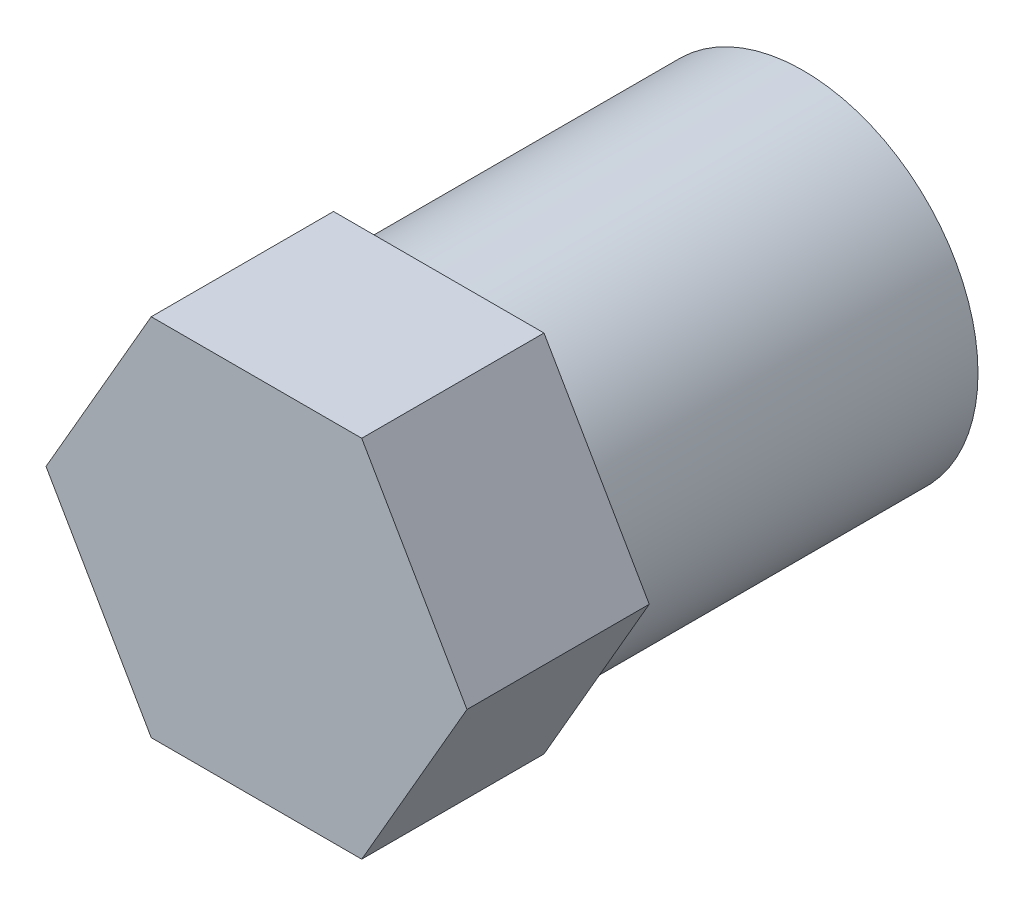
ISO-10303-21;
HEADER;
FILE_DESCRIPTION(('STEP AP214'),'2;1');
FILE_NAME('part.step','',(''),(''),'','','');
FILE_SCHEMA(('AUTOMOTIVE_DESIGN { 1 0 10303 214 1 1 1 1 }'));
ENDSEC;
DATA;
#1=APPLICATION_CONTEXT('core data for automotive mechanical design processes');
#2=APPLICATION_PROTOCOL_DEFINITION('international standard','automotive_design',2000,#1);
#3=PRODUCT_CONTEXT('',#1,'mechanical');
#4=PRODUCT('Part','Part','',(#3));
#5=PRODUCT_RELATED_PRODUCT_CATEGORY('part','',(#4));
#6=PRODUCT_DEFINITION_FORMATION('','',#4);
#7=PRODUCT_DEFINITION_CONTEXT('part definition',#1,'design');
#8=PRODUCT_DEFINITION('design','',#6,#7);
#9=PRODUCT_DEFINITION_SHAPE('','',#8);
#10=(LENGTH_UNIT() NAMED_UNIT(*) SI_UNIT(.MILLI.,.METRE.));
#11=(NAMED_UNIT(*) PLANE_ANGLE_UNIT() SI_UNIT($,.RADIAN.));
#12=(NAMED_UNIT(*) SI_UNIT($,.STERADIAN.) SOLID_ANGLE_UNIT());
#13=UNCERTAINTY_MEASURE_WITH_UNIT(LENGTH_MEASURE(1.E-05),#10,'distance_accuracy_value','');
#14=(GEOMETRIC_REPRESENTATION_CONTEXT(3) GLOBAL_UNCERTAINTY_ASSIGNED_CONTEXT((#13)) GLOBAL_UNIT_ASSIGNED_CONTEXT((#10,
#11,#12)) REPRESENTATION_CONTEXT('',''));
#15=CARTESIAN_POINT('',(0.,0.,0.));
#16=DIRECTION('',(0.,0.,1.));
#17=DIRECTION('',(1.,0.,0.));
#18=AXIS2_PLACEMENT_3D('',#15,#16,#17);
#19=CARTESIAN_POINT('',(-5.19615242270663,2.99999999999998,6.));
#20=DIRECTION('',(0.86602540378444,-0.499999999999998,0.));
#21=DIRECTION('',(0.499999999999998,0.86602540378444,0.));
#22=AXIS2_PLACEMENT_3D('',#19,#20,#21);
#23=PLANE('',#22);
#24=DIRECTION('',(-0.499999999999998,-0.86602540378444,0.));
#25=VECTOR('',#24,1.);
#26=CARTESIAN_POINT('',(-5.19615242270663,2.99999999999998,0.));
#27=LINE('',#26,#25);
#28=CARTESIAN_POINT('',(-3.46410161513775,6.,0.));
#29=VERTEX_POINT('',#28);
#30=CARTESIAN_POINT('',(-6.92820323027548,0.,0.));
#31=VERTEX_POINT('',#30);
#32=EDGE_CURVE('E128',#29,#31,#27,.T.);
#33=ORIENTED_EDGE('',*,*,#32,.T.);
#34=DIRECTION('',(0.,0.,-1.));
#35=VECTOR('',#34,1.);
#36=CARTESIAN_POINT('',(-6.92820323027548,0.,6.));
#37=LINE('',#36,#35);
#38=CARTESIAN_POINT('',(-6.92820323027548,0.,6.));
#39=VERTEX_POINT('',#38);
#40=EDGE_CURVE('E51',#39,#31,#37,.T.);
#41=ORIENTED_EDGE('',*,*,#40,.F.);
#42=DIRECTION('',(-0.499999999999998,-0.86602540378444,0.));
#43=VECTOR('',#42,1.);
#44=CARTESIAN_POINT('',(-5.19615242270663,2.99999999999998,6.));
#45=LINE('',#44,#43);
#46=CARTESIAN_POINT('',(-3.46410161513775,6.,6.));
#47=VERTEX_POINT('',#46);
#48=EDGE_CURVE('E139',#47,#39,#45,.T.);
#49=ORIENTED_EDGE('',*,*,#48,.F.);
#50=DIRECTION('',(0.,0.,-1.));
#51=VECTOR('',#50,1.);
#52=CARTESIAN_POINT('',(-3.46410161513775,6.,6.));
#53=LINE('',#52,#51);
#54=EDGE_CURVE('E124',#47,#29,#53,.T.);
#55=ORIENTED_EDGE('',*,*,#54,.T.);
#56=EDGE_LOOP('',(#33,#41,#49,#55));
#57=FACE_BOUND('',#56,.T.);
#58=ADVANCED_FACE('F43',(#57),#23,.F.);
#59=CARTESIAN_POINT('',(-5.19615242270663,-2.99999999999998,6.));
#60=DIRECTION('',(0.86602540378444,0.499999999999997,0.));
#61=DIRECTION('',(-0.499999999999997,0.86602540378444,0.));
#62=AXIS2_PLACEMENT_3D('',#59,#60,#61);
#63=PLANE('',#62);
#64=DIRECTION('',(0.499999999999997,-0.86602540378444,0.));
#65=VECTOR('',#64,1.);
#66=CARTESIAN_POINT('',(-5.19615242270663,-2.99999999999998,0.));
#67=LINE('',#66,#65);
#68=CARTESIAN_POINT('',(-3.46410161513775,-6.,0.));
#69=VERTEX_POINT('',#68);
#70=EDGE_CURVE('E131',#31,#69,#67,.T.);
#71=ORIENTED_EDGE('',*,*,#70,.T.);
#72=DIRECTION('',(0.,0.,-1.));
#73=VECTOR('',#72,1.);
#74=CARTESIAN_POINT('',(-3.46410161513775,-6.,6.));
#75=LINE('',#74,#73);
#76=CARTESIAN_POINT('',(-3.46410161513775,-6.,6.));
#77=VERTEX_POINT('',#76);
#78=EDGE_CURVE('E143',#77,#69,#75,.T.);
#79=ORIENTED_EDGE('',*,*,#78,.F.);
#80=DIRECTION('',(0.499999999999997,-0.86602540378444,0.));
#81=VECTOR('',#80,1.);
#82=CARTESIAN_POINT('',(-5.19615242270663,-2.99999999999998,6.));
#83=LINE('',#82,#81);
#84=EDGE_CURVE('E97',#39,#77,#83,.T.);
#85=ORIENTED_EDGE('',*,*,#84,.F.);
#86=ORIENTED_EDGE('',*,*,#40,.T.);
#87=EDGE_LOOP('',(#71,#79,#85,#86));
#88=FACE_BOUND('',#87,.T.);
#89=ADVANCED_FACE('F146',(#88),#63,.F.);
#90=CARTESIAN_POINT('',(0.,-6.,6.));
#91=DIRECTION('',(0.,1.,0.));
#92=DIRECTION('',(-1.,0.,0.));
#93=AXIS2_PLACEMENT_3D('',#90,#91,#92);
#94=PLANE('',#93);
#95=DIRECTION('',(1.,0.,0.));
#96=VECTOR('',#95,1.);
#97=CARTESIAN_POINT('',(0.,-6.,0.));
#98=LINE('',#97,#96);
#99=CARTESIAN_POINT('',(3.46410161513775,-6.,0.));
#100=VERTEX_POINT('',#99);
#101=EDGE_CURVE('E134',#69,#100,#98,.T.);
#102=ORIENTED_EDGE('',*,*,#101,.T.);
#103=DIRECTION('',(0.,0.,-1.));
#104=VECTOR('',#103,1.);
#105=CARTESIAN_POINT('',(3.46410161513775,-6.,6.));
#106=LINE('',#105,#104);
#107=CARTESIAN_POINT('',(3.46410161513775,-6.,6.));
#108=VERTEX_POINT('',#107);
#109=EDGE_CURVE('E119',#108,#100,#106,.T.);
#110=ORIENTED_EDGE('',*,*,#109,.F.);
#111=DIRECTION('',(1.,0.,0.));
#112=VECTOR('',#111,1.);
#113=CARTESIAN_POINT('',(0.,-6.,6.));
#114=LINE('',#113,#112);
#115=EDGE_CURVE('E110',#77,#108,#114,.T.);
#116=ORIENTED_EDGE('',*,*,#115,.F.);
#117=ORIENTED_EDGE('',*,*,#78,.T.);
#118=EDGE_LOOP('',(#102,#110,#116,#117));
#119=FACE_BOUND('',#118,.T.);
#120=ADVANCED_FACE('F154',(#119),#94,.F.);
#121=CARTESIAN_POINT('',(5.19615242270663,-2.99999999999998,6.));
#122=DIRECTION('',(-0.86602540378444,0.499999999999998,0.));
#123=DIRECTION('',(-0.499999999999998,-0.86602540378444,0.));
#124=AXIS2_PLACEMENT_3D('',#121,#122,#123);
#125=PLANE('',#124);
#126=DIRECTION('',(0.499999999999998,0.86602540378444,0.));
#127=VECTOR('',#126,1.);
#128=CARTESIAN_POINT('',(5.19615242270663,-2.99999999999998,0.));
#129=LINE('',#128,#127);
#130=CARTESIAN_POINT('',(6.92820323027548,0.,0.));
#131=VERTEX_POINT('',#130);
#132=EDGE_CURVE('E118',#100,#131,#129,.T.);
#133=ORIENTED_EDGE('',*,*,#132,.T.);
#134=DIRECTION('',(0.,0.,-1.));
#135=VECTOR('',#134,1.);
#136=CARTESIAN_POINT('',(6.92820323027548,0.,6.));
#137=LINE('',#136,#135);
#138=CARTESIAN_POINT('',(6.92820323027548,0.,6.));
#139=VERTEX_POINT('',#138);
#140=EDGE_CURVE('E115',#139,#131,#137,.T.);
#141=ORIENTED_EDGE('',*,*,#140,.F.);
#142=DIRECTION('',(0.499999999999998,0.86602540378444,0.));
#143=VECTOR('',#142,1.);
#144=CARTESIAN_POINT('',(5.19615242270663,-2.99999999999998,6.));
#145=LINE('',#144,#143);
#146=EDGE_CURVE('E104',#108,#139,#145,.T.);
#147=ORIENTED_EDGE('',*,*,#146,.F.);
#148=ORIENTED_EDGE('',*,*,#109,.T.);
#149=EDGE_LOOP('',(#133,#141,#147,#148));
#150=FACE_BOUND('',#149,.T.);
#151=ADVANCED_FACE('F116',(#150),#125,.F.);
#152=CARTESIAN_POINT('',(5.19615242270663,2.99999999999998,6.));
#153=DIRECTION('',(-0.86602540378444,-0.499999999999998,0.));
#154=DIRECTION('',(0.499999999999998,-0.86602540378444,0.));
#155=AXIS2_PLACEMENT_3D('',#152,#153,#154);
#156=PLANE('',#155);
#157=DIRECTION('',(-0.499999999999998,0.86602540378444,0.));
#158=VECTOR('',#157,1.);
#159=CARTESIAN_POINT('',(5.19615242270663,2.99999999999998,0.));
#160=LINE('',#159,#158);
#161=CARTESIAN_POINT('',(3.46410161513775,6.,0.));
#162=VERTEX_POINT('',#161);
#163=EDGE_CURVE('E82',#131,#162,#160,.T.);
#164=ORIENTED_EDGE('',*,*,#163,.T.);
#165=DIRECTION('',(0.,0.,-1.));
#166=VECTOR('',#165,1.);
#167=CARTESIAN_POINT('',(3.46410161513775,6.,6.));
#168=LINE('',#167,#166);
#169=CARTESIAN_POINT('',(3.46410161513775,6.,6.));
#170=VERTEX_POINT('',#169);
#171=EDGE_CURVE('E120',#170,#162,#168,.T.);
#172=ORIENTED_EDGE('',*,*,#171,.F.);
#173=DIRECTION('',(-0.499999999999998,0.86602540378444,0.));
#174=VECTOR('',#173,1.);
#175=CARTESIAN_POINT('',(5.19615242270663,2.99999999999998,6.));
#176=LINE('',#175,#174);
#177=EDGE_CURVE('E108',#139,#170,#176,.T.);
#178=ORIENTED_EDGE('',*,*,#177,.F.);
#179=ORIENTED_EDGE('',*,*,#140,.T.);
#180=EDGE_LOOP('',(#164,#172,#178,#179));
#181=FACE_BOUND('',#180,.T.);
#182=ADVANCED_FACE('F122',(#181),#156,.F.);
#183=CARTESIAN_POINT('',(0.,6.,6.));
#184=DIRECTION('',(0.,-1.,0.));
#185=DIRECTION('',(1.,0.,0.));
#186=AXIS2_PLACEMENT_3D('',#183,#184,#185);
#187=PLANE('',#186);
#188=DIRECTION('',(-1.,0.,0.));
#189=VECTOR('',#188,1.);
#190=CARTESIAN_POINT('',(0.,6.,0.));
#191=LINE('',#190,#189);
#192=EDGE_CURVE('E88',#162,#29,#191,.T.);
#193=ORIENTED_EDGE('',*,*,#192,.T.);
#194=ORIENTED_EDGE('',*,*,#54,.F.);
#195=DIRECTION('',(-1.,0.,0.));
#196=VECTOR('',#195,1.);
#197=CARTESIAN_POINT('',(0.,6.,6.));
#198=LINE('',#197,#196);
#199=EDGE_CURVE('E59',#170,#47,#198,.T.);
#200=ORIENTED_EDGE('',*,*,#199,.F.);
#201=ORIENTED_EDGE('',*,*,#171,.T.);
#202=EDGE_LOOP('',(#193,#194,#200,#201));
#203=FACE_BOUND('',#202,.T.);
#204=ADVANCED_FACE('F200',(#203),#187,.F.);
#205=CARTESIAN_POINT('',(0.,0.,6.));
#206=DIRECTION('',(0.,0.,1.));
#207=DIRECTION('',(1.,0.,0.));
#208=AXIS2_PLACEMENT_3D('',#205,#206,#207);
#209=PLANE('',#208);
#210=ORIENTED_EDGE('',*,*,#48,.T.);
#211=ORIENTED_EDGE('',*,*,#84,.T.);
#212=ORIENTED_EDGE('',*,*,#115,.T.);
#213=ORIENTED_EDGE('',*,*,#146,.T.);
#214=ORIENTED_EDGE('',*,*,#177,.T.);
#215=ORIENTED_EDGE('',*,*,#199,.T.);
#216=EDGE_LOOP('',(#210,#211,#212,#213,#214,#215));
#217=FACE_BOUND('',#216,.T.);
#218=ADVANCED_FACE('F106',(#217),#209,.T.);
#219=CARTESIAN_POINT('',(0.,0.,0.));
#220=DIRECTION('',(0.,0.,1.));
#221=DIRECTION('',(1.,0.,0.));
#222=AXIS2_PLACEMENT_3D('',#219,#220,#221);
#223=PLANE('',#222);
#224=CARTESIAN_POINT('',(0.,0.,0.));
#225=DIRECTION('',(0.,0.,1.));
#226=DIRECTION('',(1.,0.,0.));
#227=AXIS2_PLACEMENT_3D('',#224,#225,#226);
#228=CIRCLE('',#227,5.75);
#229=CARTESIAN_POINT('',(5.75,0.,0.));
#230=VERTEX_POINT('',#229);
#231=EDGE_CURVE('E158',#230,#230,#228,.T.);
#232=ORIENTED_EDGE('',*,*,#231,.T.);
#233=EDGE_LOOP('',(#232));
#234=FACE_BOUND('',#233,.T.);
#235=ORIENTED_EDGE('',*,*,#32,.F.);
#236=ORIENTED_EDGE('',*,*,#192,.F.);
#237=ORIENTED_EDGE('',*,*,#163,.F.);
#238=ORIENTED_EDGE('',*,*,#132,.F.);
#239=ORIENTED_EDGE('',*,*,#101,.F.);
#240=ORIENTED_EDGE('',*,*,#70,.F.);
#241=EDGE_LOOP('',(#235,#236,#237,#238,#239,#240));
#242=FACE_BOUND('',#241,.T.);
#243=ADVANCED_FACE('F151',(#234,#242),#223,.F.);
#244=CARTESIAN_POINT('',(0.,0.,-12.));
#245=DIRECTION('',(0.,0.,1.));
#246=DIRECTION('',(1.,0.,0.));
#247=AXIS2_PLACEMENT_3D('',#244,#245,#246);
#248=CYLINDRICAL_SURFACE('',#247,3.);
#249=CARTESIAN_POINT('',(0.,0.,-12.));
#250=DIRECTION('',(0.,0.,1.));
#251=DIRECTION('',(1.,0.,0.));
#252=AXIS2_PLACEMENT_3D('',#249,#250,#251);
#253=CIRCLE('',#252,3.);
#254=CARTESIAN_POINT('',(3.,0.,-12.));
#255=VERTEX_POINT('',#254);
#256=EDGE_CURVE('E161',#255,#255,#253,.T.);
#257=ORIENTED_EDGE('',*,*,#256,.F.);
#258=EDGE_LOOP('',(#257));
#259=FACE_BOUND('',#258,.T.);
#260=CARTESIAN_POINT('',(0.,0.,0.));
#261=DIRECTION('',(0.,0.,1.));
#262=DIRECTION('',(1.,0.,0.));
#263=AXIS2_PLACEMENT_3D('',#260,#261,#262);
#264=CIRCLE('',#263,3.);
#265=CARTESIAN_POINT('',(3.,0.,0.));
#266=VERTEX_POINT('',#265);
#267=EDGE_CURVE('E11',#266,#266,#264,.T.);
#268=ORIENTED_EDGE('',*,*,#267,.T.);
#269=EDGE_LOOP('',(#268));
#270=FACE_BOUND('',#269,.T.);
#271=ADVANCED_FACE('F170',(#259,#270),#248,.F.);
#272=CARTESIAN_POINT('',(0.,0.,-12.));
#273=DIRECTION('',(0.,0.,1.));
#274=DIRECTION('',(1.,0.,0.));
#275=AXIS2_PLACEMENT_3D('',#272,#273,#274);
#276=CYLINDRICAL_SURFACE('',#275,5.75);
#277=CARTESIAN_POINT('',(0.,0.,-12.));
#278=DIRECTION('',(0.,0.,1.));
#279=DIRECTION('',(1.,0.,0.));
#280=AXIS2_PLACEMENT_3D('',#277,#278,#279);
#281=CIRCLE('',#280,5.75);
#282=CARTESIAN_POINT('',(5.75,0.,-12.));
#283=VERTEX_POINT('',#282);
#284=EDGE_CURVE('E132',#283,#283,#281,.T.);
#285=ORIENTED_EDGE('',*,*,#284,.T.);
#286=EDGE_LOOP('',(#285));
#287=FACE_BOUND('',#286,.T.);
#288=ORIENTED_EDGE('',*,*,#231,.F.);
#289=EDGE_LOOP('',(#288));
#290=FACE_BOUND('',#289,.T.);
#291=ADVANCED_FACE('F173',(#287,#290),#276,.T.);
#292=CARTESIAN_POINT('',(0.,0.,-12.));
#293=DIRECTION('',(0.,0.,1.));
#294=DIRECTION('',(1.,0.,0.));
#295=AXIS2_PLACEMENT_3D('',#292,#293,#294);
#296=PLANE('',#295);
#297=ORIENTED_EDGE('',*,*,#256,.T.);
#298=EDGE_LOOP('',(#297));
#299=FACE_BOUND('',#298,.T.);
#300=ORIENTED_EDGE('',*,*,#284,.F.);
#301=EDGE_LOOP('',(#300));
#302=FACE_BOUND('',#301,.T.);
#303=ADVANCED_FACE('F167',(#299,#302),#296,.F.);
#304=ORIENTED_EDGE('',*,*,#267,.F.);
#305=EDGE_LOOP('',(#304));
#306=FACE_BOUND('',#305,.T.);
#307=ADVANCED_FACE('F177',(#306),#223,.F.);
#308=CLOSED_SHELL('',(#58,#89,#120,#151,#182,#204,#218,#243,#271,#291,#303,#307));
#309=MANIFOLD_SOLID_BREP('B2',#308);
#310=ADVANCED_BREP_SHAPE_REPRESENTATION('',(#18,#309),#14);
#311=SHAPE_DEFINITION_REPRESENTATION(#9,#310);
ENDSEC;
END-ISO-10303-21;
